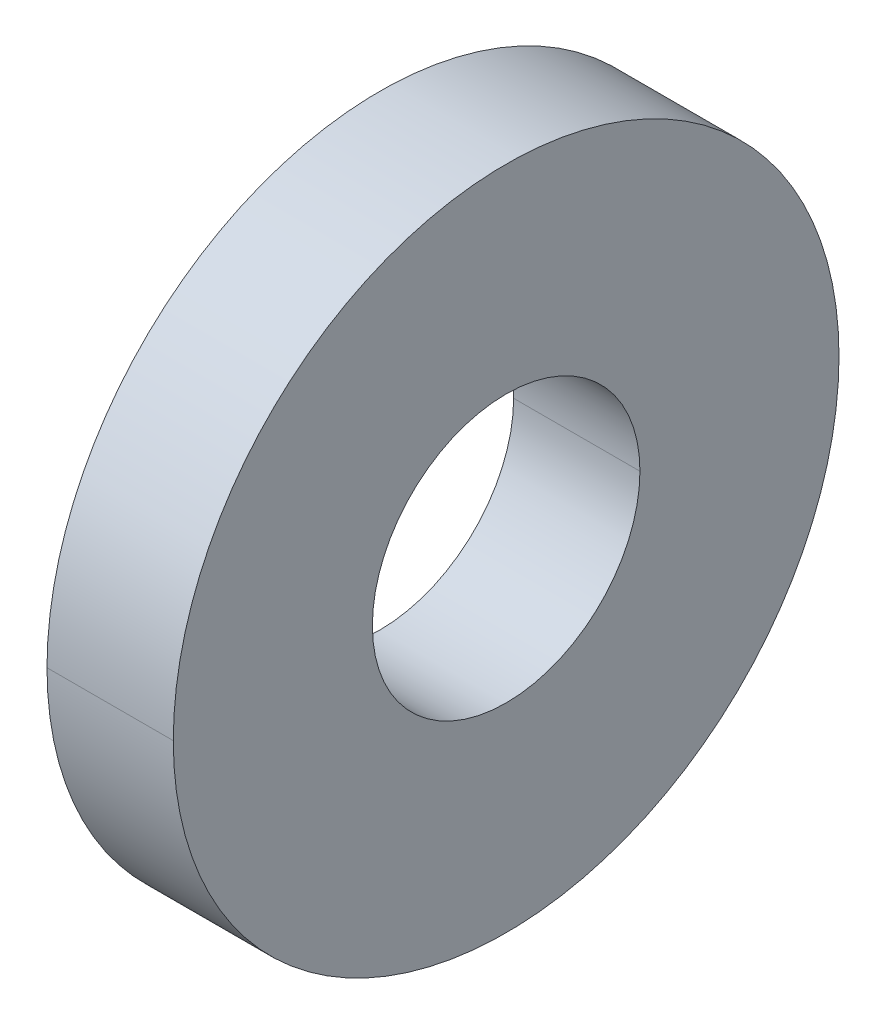
ISO-10303-21;
HEADER;
FILE_DESCRIPTION(('STEP AP214'),'2;1');
FILE_NAME('part.step','',(''),(''),'','','');
FILE_SCHEMA(('AUTOMOTIVE_DESIGN { 1 0 10303 214 1 1 1 1 }'));
ENDSEC;
DATA;
#1=APPLICATION_CONTEXT('core data for automotive mechanical design processes');
#2=APPLICATION_PROTOCOL_DEFINITION('international standard','automotive_design',2000,#1);
#3=PRODUCT_CONTEXT('',#1,'mechanical');
#4=PRODUCT('Part','Part','',(#3));
#5=PRODUCT_RELATED_PRODUCT_CATEGORY('part','',(#4));
#6=PRODUCT_DEFINITION_FORMATION('','',#4);
#7=PRODUCT_DEFINITION_CONTEXT('part definition',#1,'design');
#8=PRODUCT_DEFINITION('design','',#6,#7);
#9=PRODUCT_DEFINITION_SHAPE('','',#8);
#10=(LENGTH_UNIT() NAMED_UNIT(*) SI_UNIT(.MILLI.,.METRE.));
#11=(NAMED_UNIT(*) PLANE_ANGLE_UNIT() SI_UNIT($,.RADIAN.));
#12=(NAMED_UNIT(*) SI_UNIT($,.STERADIAN.) SOLID_ANGLE_UNIT());
#13=UNCERTAINTY_MEASURE_WITH_UNIT(LENGTH_MEASURE(1.E-05),#10,'distance_accuracy_value','');
#14=(GEOMETRIC_REPRESENTATION_CONTEXT(3) GLOBAL_UNCERTAINTY_ASSIGNED_CONTEXT((#13)) GLOBAL_UNIT_ASSIGNED_CONTEXT((#10,
#11,#12)) REPRESENTATION_CONTEXT('',''));
#15=CARTESIAN_POINT('',(0.,0.,0.));
#16=DIRECTION('',(0.,0.,1.));
#17=DIRECTION('',(1.,0.,0.));
#18=AXIS2_PLACEMENT_3D('',#15,#16,#17);
#19=CARTESIAN_POINT('',(-1.4986,7.8994,0.));
#20=DIRECTION('',(-1.,0.,0.));
#21=DIRECTION('',(0.,0.,1.));
#22=AXIS2_PLACEMENT_3D('',#19,#20,#21);
#23=PLANE('',#22);
#24=CARTESIAN_POINT('',(-1.4986,0.,0.));
#25=DIRECTION('',(1.,0.,0.));
#26=DIRECTION('',(0.,0.,-1.));
#27=AXIS2_PLACEMENT_3D('',#24,#25,#26);
#28=CIRCLE('',#27,3.175);
#29=CARTESIAN_POINT('',(-1.4986,0.,-3.175));
#30=VERTEX_POINT('',#29);
#31=CARTESIAN_POINT('',(-1.4986,0.,3.175));
#32=VERTEX_POINT('',#31);
#33=EDGE_CURVE('E11',#30,#32,#28,.T.);
#34=ORIENTED_EDGE('',*,*,#33,.T.);
#35=CARTESIAN_POINT('',(-1.4986,0.,0.));
#36=DIRECTION('',(1.,0.,0.));
#37=DIRECTION('',(0.,0.,-1.));
#38=AXIS2_PLACEMENT_3D('',#35,#36,#37);
#39=CIRCLE('',#38,3.175);
#40=EDGE_CURVE('E24',#32,#30,#39,.T.);
#41=ORIENTED_EDGE('',*,*,#40,.T.);
#42=EDGE_LOOP('',(#34,#41));
#43=FACE_BOUND('',#42,.T.);
#44=CARTESIAN_POINT('',(-1.4986,0.,0.));
#45=DIRECTION('',(1.,0.,0.));
#46=DIRECTION('',(0.,0.,-1.));
#47=AXIS2_PLACEMENT_3D('',#44,#45,#46);
#48=CIRCLE('',#47,7.8994);
#49=CARTESIAN_POINT('',(-1.4986,0.,-7.8994));
#50=VERTEX_POINT('',#49);
#51=CARTESIAN_POINT('',(-1.4986,0.,7.8994));
#52=VERTEX_POINT('',#51);
#53=EDGE_CURVE('E142',#50,#52,#48,.T.);
#54=ORIENTED_EDGE('',*,*,#53,.F.);
#55=CARTESIAN_POINT('',(-1.4986,0.,0.));
#56=DIRECTION('',(1.,0.,0.));
#57=DIRECTION('',(0.,0.,-1.));
#58=AXIS2_PLACEMENT_3D('',#55,#56,#57);
#59=CIRCLE('',#58,7.8994);
#60=EDGE_CURVE('E140',#52,#50,#59,.T.);
#61=ORIENTED_EDGE('',*,*,#60,.F.);
#62=EDGE_LOOP('',(#54,#61));
#63=FACE_BOUND('',#62,.T.);
#64=ADVANCED_FACE('F16',(#43,#63),#23,.T.);
#65=CARTESIAN_POINT('',(1.4986,0.,0.));
#66=DIRECTION('',(-1.,0.,0.));
#67=DIRECTION('',(0.,1.,0.));
#68=AXIS2_PLACEMENT_3D('',#65,#66,#67);
#69=CYLINDRICAL_SURFACE('',#68,7.8994);
#70=ORIENTED_EDGE('',*,*,#60,.T.);
#71=CARTESIAN_POINT('',(1.4986,0.,-7.8994));
#72=DIRECTION('',(-1.,0.,0.));
#73=VECTOR('',#72,1.);
#74=LINE('',#71,#73);
#75=CARTESIAN_POINT('',(1.4986,0.,-7.8994));
#76=VERTEX_POINT('',#75);
#77=EDGE_CURVE('E110',#76,#50,#74,.T.);
#78=ORIENTED_EDGE('',*,*,#77,.F.);
#79=CARTESIAN_POINT('',(1.4986,0.,0.));
#80=DIRECTION('',(1.,0.,0.));
#81=DIRECTION('',(0.,0.,-1.));
#82=AXIS2_PLACEMENT_3D('',#79,#80,#81);
#83=CIRCLE('',#82,7.8994);
#84=CARTESIAN_POINT('',(1.4986,0.,7.8994));
#85=VERTEX_POINT('',#84);
#86=EDGE_CURVE('E126',#85,#76,#83,.T.);
#87=ORIENTED_EDGE('',*,*,#86,.F.);
#88=CARTESIAN_POINT('',(1.4986,0.,7.8994));
#89=DIRECTION('',(-1.,0.,0.));
#90=VECTOR('',#89,1.);
#91=LINE('',#88,#90);
#92=EDGE_CURVE('E72',#85,#52,#91,.T.);
#93=ORIENTED_EDGE('',*,*,#92,.T.);
#94=EDGE_LOOP('',(#70,#78,#87,#93));
#95=FACE_BOUND('',#94,.T.);
#96=ADVANCED_FACE('F94',(#95),#69,.T.);
#97=CARTESIAN_POINT('',(1.4986,0.,0.));
#98=DIRECTION('',(-1.,0.,0.));
#99=DIRECTION('',(0.,-1.,0.));
#100=AXIS2_PLACEMENT_3D('',#97,#98,#99);
#101=CYLINDRICAL_SURFACE('',#100,7.8994);
#102=CARTESIAN_POINT('',(1.4986,0.,0.));
#103=DIRECTION('',(1.,0.,0.));
#104=DIRECTION('',(0.,0.,-1.));
#105=AXIS2_PLACEMENT_3D('',#102,#103,#104);
#106=CIRCLE('',#105,7.8994);
#107=EDGE_CURVE('E69',#76,#85,#106,.T.);
#108=ORIENTED_EDGE('',*,*,#107,.F.);
#109=ORIENTED_EDGE('',*,*,#77,.T.);
#110=ORIENTED_EDGE('',*,*,#53,.T.);
#111=ORIENTED_EDGE('',*,*,#92,.F.);
#112=EDGE_LOOP('',(#108,#109,#110,#111));
#113=FACE_BOUND('',#112,.T.);
#114=ADVANCED_FACE('F85',(#113),#101,.T.);
#115=CARTESIAN_POINT('',(1.4986,3.175,0.));
#116=DIRECTION('',(1.,0.,0.));
#117=DIRECTION('',(0.,0.,-1.));
#118=AXIS2_PLACEMENT_3D('',#115,#116,#117);
#119=PLANE('',#118);
#120=ORIENTED_EDGE('',*,*,#107,.T.);
#121=ORIENTED_EDGE('',*,*,#86,.T.);
#122=EDGE_LOOP('',(#120,#121));
#123=FACE_BOUND('',#122,.T.);
#124=CARTESIAN_POINT('',(1.4986,0.,0.));
#125=DIRECTION('',(1.,0.,0.));
#126=DIRECTION('',(0.,0.,-1.));
#127=AXIS2_PLACEMENT_3D('',#124,#125,#126);
#128=CIRCLE('',#127,3.175);
#129=CARTESIAN_POINT('',(1.4986,0.,-3.175));
#130=VERTEX_POINT('',#129);
#131=CARTESIAN_POINT('',(1.4986,0.,3.175));
#132=VERTEX_POINT('',#131);
#133=EDGE_CURVE('E55',#130,#132,#128,.T.);
#134=ORIENTED_EDGE('',*,*,#133,.F.);
#135=CARTESIAN_POINT('',(1.4986,0.,0.));
#136=DIRECTION('',(1.,0.,0.));
#137=DIRECTION('',(0.,0.,-1.));
#138=AXIS2_PLACEMENT_3D('',#135,#136,#137);
#139=CIRCLE('',#138,3.175);
#140=EDGE_CURVE('E51',#132,#130,#139,.T.);
#141=ORIENTED_EDGE('',*,*,#140,.F.);
#142=EDGE_LOOP('',(#134,#141));
#143=FACE_BOUND('',#142,.T.);
#144=ADVANCED_FACE('F53',(#123,#143),#119,.T.);
#145=CARTESIAN_POINT('',(1.4986,0.,0.));
#146=DIRECTION('',(-1.,0.,0.));
#147=DIRECTION('',(0.,1.,0.));
#148=AXIS2_PLACEMENT_3D('',#145,#146,#147);
#149=CYLINDRICAL_SURFACE('',#148,3.175);
#150=ORIENTED_EDGE('',*,*,#40,.F.);
#151=CARTESIAN_POINT('',(1.4986,0.,3.175));
#152=DIRECTION('',(-1.,0.,0.));
#153=VECTOR('',#152,1.);
#154=LINE('',#151,#153);
#155=EDGE_CURVE('E58',#132,#32,#154,.T.);
#156=ORIENTED_EDGE('',*,*,#155,.F.);
#157=ORIENTED_EDGE('',*,*,#140,.T.);
#158=CARTESIAN_POINT('',(1.4986,0.,-3.175));
#159=DIRECTION('',(-1.,0.,0.));
#160=VECTOR('',#159,1.);
#161=LINE('',#158,#160);
#162=EDGE_CURVE('E65',#130,#30,#161,.T.);
#163=ORIENTED_EDGE('',*,*,#162,.T.);
#164=EDGE_LOOP('',(#150,#156,#157,#163));
#165=FACE_BOUND('',#164,.T.);
#166=ADVANCED_FACE('F62',(#165),#149,.F.);
#167=CARTESIAN_POINT('',(1.4986,0.,0.));
#168=DIRECTION('',(-1.,0.,0.));
#169=DIRECTION('',(0.,-1.,0.));
#170=AXIS2_PLACEMENT_3D('',#167,#168,#169);
#171=CYLINDRICAL_SURFACE('',#170,3.175);
#172=ORIENTED_EDGE('',*,*,#133,.T.);
#173=ORIENTED_EDGE('',*,*,#155,.T.);
#174=ORIENTED_EDGE('',*,*,#33,.F.);
#175=ORIENTED_EDGE('',*,*,#162,.F.);
#176=EDGE_LOOP('',(#172,#173,#174,#175));
#177=FACE_BOUND('',#176,.T.);
#178=ADVANCED_FACE('F67',(#177),#171,.F.);
#179=CLOSED_SHELL('',(#64,#96,#114,#144,#166,#178));
#180=MANIFOLD_SOLID_BREP('B1',#179);
#181=ADVANCED_BREP_SHAPE_REPRESENTATION('',(#18,#180),#14);
#182=SHAPE_DEFINITION_REPRESENTATION(#9,#181);
ENDSEC;
END-ISO-10303-21;
